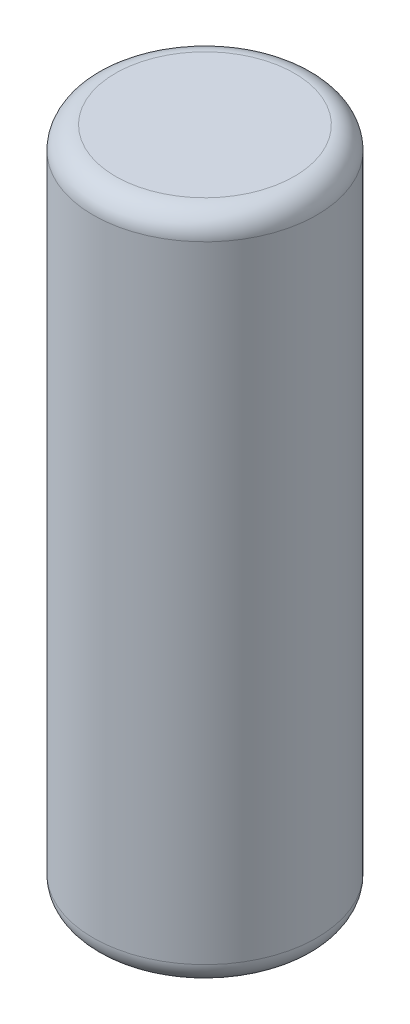
ISO-10303-21;
HEADER;
FILE_DESCRIPTION(('STEP AP214'),'2;1');
FILE_NAME('part.step','',(''),(''),'','','');
FILE_SCHEMA(('AUTOMOTIVE_DESIGN { 1 0 10303 214 1 1 1 1 }'));
ENDSEC;
DATA;
#1=APPLICATION_CONTEXT('core data for automotive mechanical design processes');
#2=APPLICATION_PROTOCOL_DEFINITION('international standard','automotive_design',2000,#1);
#3=PRODUCT_CONTEXT('',#1,'mechanical');
#4=PRODUCT('Part','Part','',(#3));
#5=PRODUCT_RELATED_PRODUCT_CATEGORY('part','',(#4));
#6=PRODUCT_DEFINITION_FORMATION('','',#4);
#7=PRODUCT_DEFINITION_CONTEXT('part definition',#1,'design');
#8=PRODUCT_DEFINITION('design','',#6,#7);
#9=PRODUCT_DEFINITION_SHAPE('','',#8);
#10=(LENGTH_UNIT() NAMED_UNIT(*) SI_UNIT(.MILLI.,.METRE.));
#11=(NAMED_UNIT(*) PLANE_ANGLE_UNIT() SI_UNIT($,.RADIAN.));
#12=(NAMED_UNIT(*) SI_UNIT($,.STERADIAN.) SOLID_ANGLE_UNIT());
#13=UNCERTAINTY_MEASURE_WITH_UNIT(LENGTH_MEASURE(1.E-05),#10,'distance_accuracy_value','');
#14=(GEOMETRIC_REPRESENTATION_CONTEXT(3) GLOBAL_UNCERTAINTY_ASSIGNED_CONTEXT((#13)) GLOBAL_UNIT_ASSIGNED_CONTEXT((#10,
#11,#12)) REPRESENTATION_CONTEXT('',''));
#15=CARTESIAN_POINT('',(0.,0.,0.));
#16=DIRECTION('',(0.,0.,1.));
#17=DIRECTION('',(1.,0.,0.));
#18=AXIS2_PLACEMENT_3D('',#15,#16,#17);
#19=CARTESIAN_POINT('',(0.,381.,0.));
#20=DIRECTION('',(0.,-1.,0.));
#21=DIRECTION('',(0.,0.,-1.));
#22=AXIS2_PLACEMENT_3D('',#19,#20,#21);
#23=CYLINDRICAL_SURFACE('',#22,63.5);
#24=CARTESIAN_POINT('',(0.,12.7,0.));
#25=DIRECTION('',(0.,1.,0.));
#26=DIRECTION('',(0.,0.,1.));
#27=AXIS2_PLACEMENT_3D('',#24,#25,#26);
#28=CIRCLE('',#27,63.5);
#29=CARTESIAN_POINT('',(0.,12.7,63.5));
#30=VERTEX_POINT('',#29);
#31=EDGE_CURVE('E52',#30,#30,#28,.T.);
#32=ORIENTED_EDGE('',*,*,#31,.T.);
#33=EDGE_LOOP('',(#32));
#34=FACE_BOUND('',#33,.T.);
#35=CARTESIAN_POINT('',(0.,368.3,0.));
#36=DIRECTION('',(0.,1.,0.));
#37=DIRECTION('',(0.,0.,1.));
#38=AXIS2_PLACEMENT_3D('',#35,#36,#37);
#39=CIRCLE('',#38,63.5);
#40=CARTESIAN_POINT('',(0.,368.3,63.5));
#41=VERTEX_POINT('',#40);
#42=EDGE_CURVE('E56',#41,#41,#39,.F.);
#43=ORIENTED_EDGE('',*,*,#42,.T.);
#44=EDGE_LOOP('',(#43));
#45=FACE_BOUND('',#44,.T.);
#46=ADVANCED_FACE('F41',(#34,#45),#23,.T.);
#47=CARTESIAN_POINT('',(0.,381.,0.));
#48=DIRECTION('',(0.,1.,0.));
#49=DIRECTION('',(0.,0.,1.));
#50=AXIS2_PLACEMENT_3D('',#47,#48,#49);
#51=PLANE('',#50);
#52=CARTESIAN_POINT('',(0.,381.,0.));
#53=DIRECTION('',(0.,1.,0.));
#54=DIRECTION('',(0.,0.,1.));
#55=AXIS2_PLACEMENT_3D('',#52,#53,#54);
#56=CIRCLE('',#55,50.8);
#57=CARTESIAN_POINT('',(0.,381.,50.8));
#58=VERTEX_POINT('',#57);
#59=EDGE_CURVE('E10',#58,#58,#56,.T.);
#60=ORIENTED_EDGE('',*,*,#59,.T.);
#61=EDGE_LOOP('',(#60));
#62=FACE_BOUND('',#61,.T.);
#63=ADVANCED_FACE('F72',(#62),#51,.T.);
#64=CARTESIAN_POINT('',(0.,0.,0.));
#65=DIRECTION('',(0.,1.,0.));
#66=DIRECTION('',(0.,0.,1.));
#67=AXIS2_PLACEMENT_3D('',#64,#65,#66);
#68=PLANE('',#67);
#69=CARTESIAN_POINT('',(0.,0.,0.));
#70=DIRECTION('',(0.,1.,0.));
#71=DIRECTION('',(0.,0.,1.));
#72=AXIS2_PLACEMENT_3D('',#69,#70,#71);
#73=CIRCLE('',#72,50.8);
#74=CARTESIAN_POINT('',(0.,0.,50.8));
#75=VERTEX_POINT('',#74);
#76=EDGE_CURVE('E48',#75,#75,#73,.F.);
#77=ORIENTED_EDGE('',*,*,#76,.T.);
#78=EDGE_LOOP('',(#77));
#79=FACE_BOUND('',#78,.T.);
#80=ADVANCED_FACE('F69',(#79),#68,.F.);
#81=CARTESIAN_POINT('',(0.,12.7,0.));
#82=DIRECTION('',(0.,1.,0.));
#83=DIRECTION('',(0.,0.,1.));
#84=AXIS2_PLACEMENT_3D('',#81,#82,#83);
#85=TOROIDAL_SURFACE('',#84,50.8,12.7);
#86=ORIENTED_EDGE('',*,*,#76,.F.);
#87=EDGE_LOOP('',(#86));
#88=FACE_BOUND('',#87,.T.);
#89=ORIENTED_EDGE('',*,*,#31,.F.);
#90=EDGE_LOOP('',(#89));
#91=FACE_BOUND('',#90,.T.);
#92=ADVANCED_FACE('F65',(#88,#91),#85,.T.);
#93=CARTESIAN_POINT('',(0.,368.3,0.));
#94=DIRECTION('',(0.,1.,0.));
#95=DIRECTION('',(0.,0.,1.));
#96=AXIS2_PLACEMENT_3D('',#93,#94,#95);
#97=TOROIDAL_SURFACE('',#96,50.8,12.7);
#98=ORIENTED_EDGE('',*,*,#42,.F.);
#99=EDGE_LOOP('',(#98));
#100=FACE_BOUND('',#99,.T.);
#101=ORIENTED_EDGE('',*,*,#59,.F.);
#102=EDGE_LOOP('',(#101));
#103=FACE_BOUND('',#102,.T.);
#104=ADVANCED_FACE('F43',(#100,#103),#97,.T.);
#105=CLOSED_SHELL('',(#46,#63,#80,#92,#104));
#106=MANIFOLD_SOLID_BREP('B2',#105);
#107=ADVANCED_BREP_SHAPE_REPRESENTATION('',(#18,#106),#14);
#108=SHAPE_DEFINITION_REPRESENTATION(#9,#107);
ENDSEC;
END-ISO-10303-21;
